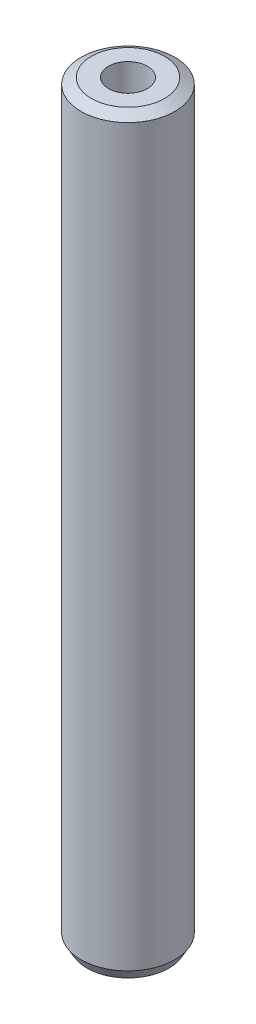
ISO-10303-21;
HEADER;
FILE_DESCRIPTION(('STEP AP214'),'2;1');
FILE_NAME('part.step','',(''),(''),'','','');
FILE_SCHEMA(('AUTOMOTIVE_DESIGN { 1 0 10303 214 1 1 1 1 }'));
ENDSEC;
DATA;
#1=APPLICATION_CONTEXT('core data for automotive mechanical design processes');
#2=APPLICATION_PROTOCOL_DEFINITION('international standard','automotive_design',2000,#1);
#3=PRODUCT_CONTEXT('',#1,'mechanical');
#4=PRODUCT('Part','Part','',(#3));
#5=PRODUCT_RELATED_PRODUCT_CATEGORY('part','',(#4));
#6=PRODUCT_DEFINITION_FORMATION('','',#4);
#7=PRODUCT_DEFINITION_CONTEXT('part definition',#1,'design');
#8=PRODUCT_DEFINITION('design','',#6,#7);
#9=PRODUCT_DEFINITION_SHAPE('','',#8);
#10=(LENGTH_UNIT() NAMED_UNIT(*) SI_UNIT(.MILLI.,.METRE.));
#11=(NAMED_UNIT(*) PLANE_ANGLE_UNIT() SI_UNIT($,.RADIAN.));
#12=(NAMED_UNIT(*) SI_UNIT($,.STERADIAN.) SOLID_ANGLE_UNIT());
#13=UNCERTAINTY_MEASURE_WITH_UNIT(LENGTH_MEASURE(1.E-05),#10,'distance_accuracy_value','');
#14=(GEOMETRIC_REPRESENTATION_CONTEXT(3) GLOBAL_UNCERTAINTY_ASSIGNED_CONTEXT((#13)) GLOBAL_UNIT_ASSIGNED_CONTEXT((#10,
#11,#12)) REPRESENTATION_CONTEXT('',''));
#15=CARTESIAN_POINT('',(0.,0.,0.));
#16=DIRECTION('',(0.,0.,1.));
#17=DIRECTION('',(1.,0.,0.));
#18=AXIS2_PLACEMENT_3D('',#15,#16,#17);
#19=CARTESIAN_POINT('',(0.,600.,0.));
#20=DIRECTION('',(0.,-1.,0.));
#21=DIRECTION('',(0.,0.,-1.));
#22=AXIS2_PLACEMENT_3D('',#19,#20,#21);
#23=CYLINDRICAL_SURFACE('',#22,37.5);
#24=CARTESIAN_POINT('',(0.,595.220577606125,0.));
#25=DIRECTION('',(0.,1.,0.));
#26=DIRECTION('',(0.,0.,1.));
#27=AXIS2_PLACEMENT_3D('',#24,#25,#26);
#28=CIRCLE('',#27,37.5);
#29=CARTESIAN_POINT('',(0.,595.220577606125,37.5));
#30=VERTEX_POINT('',#29);
#31=EDGE_CURVE('E50',#30,#30,#28,.F.);
#32=ORIENTED_EDGE('',*,*,#31,.T.);
#33=EDGE_LOOP('',(#32));
#34=FACE_BOUND('',#33,.T.);
#35=CARTESIAN_POINT('',(0.,8.27820241702459,0.));
#36=DIRECTION('',(0.,1.,0.));
#37=DIRECTION('',(0.,0.,1.));
#38=AXIS2_PLACEMENT_3D('',#35,#36,#37);
#39=CIRCLE('',#38,37.5);
#40=CARTESIAN_POINT('',(0.,8.27820241702459,37.5));
#41=VERTEX_POINT('',#40);
#42=EDGE_CURVE('E51',#41,#41,#39,.T.);
#43=ORIENTED_EDGE('',*,*,#42,.T.);
#44=EDGE_LOOP('',(#43));
#45=FACE_BOUND('',#44,.T.);
#46=ADVANCED_FACE('F39',(#34,#45),#23,.T.);
#47=CARTESIAN_POINT('',(0.,600.,0.));
#48=DIRECTION('',(0.,1.,0.));
#49=DIRECTION('',(0.,0.,1.));
#50=AXIS2_PLACEMENT_3D('',#47,#48,#49);
#51=PLANE('',#50);
#52=CARTESIAN_POINT('',(0.,600.,0.));
#53=DIRECTION('',(0.,1.,0.));
#54=DIRECTION('',(0.,0.,1.));
#55=AXIS2_PLACEMENT_3D('',#52,#53,#54);
#56=CIRCLE('',#55,29.2217975829753);
#57=CARTESIAN_POINT('',(0.,600.,29.2217975829753));
#58=VERTEX_POINT('',#57);
#59=EDGE_CURVE('E54',#58,#58,#56,.T.);
#60=ORIENTED_EDGE('',*,*,#59,.T.);
#61=EDGE_LOOP('',(#60));
#62=FACE_BOUND('',#61,.T.);
#63=CARTESIAN_POINT('',(0.,600.,0.));
#64=DIRECTION('',(0.,1.,0.));
#65=DIRECTION('',(0.,0.,1.));
#66=AXIS2_PLACEMENT_3D('',#63,#64,#65);
#67=CIRCLE('',#66,15.5380572608738);
#68=CARTESIAN_POINT('',(0.,600.,15.5380572608738));
#69=VERTEX_POINT('',#68);
#70=EDGE_CURVE('E58',#69,#69,#67,.T.);
#71=ORIENTED_EDGE('',*,*,#70,.F.);
#72=EDGE_LOOP('',(#71));
#73=FACE_BOUND('',#72,.T.);
#74=ADVANCED_FACE('F69',(#62,#73),#51,.T.);
#75=CARTESIAN_POINT('',(0.,0.,0.));
#76=DIRECTION('',(0.,1.,0.));
#77=DIRECTION('',(0.,0.,1.));
#78=AXIS2_PLACEMENT_3D('',#75,#76,#77);
#79=PLANE('',#78);
#80=CARTESIAN_POINT('',(0.,0.,0.));
#81=DIRECTION('',(0.,1.,0.));
#82=DIRECTION('',(0.,0.,1.));
#83=AXIS2_PLACEMENT_3D('',#80,#81,#82);
#84=CIRCLE('',#83,32.7205776061246);
#85=CARTESIAN_POINT('',(0.,0.,32.7205776061246));
#86=VERTEX_POINT('',#85);
#87=EDGE_CURVE('E10',#86,#86,#84,.F.);
#88=ORIENTED_EDGE('',*,*,#87,.T.);
#89=EDGE_LOOP('',(#88));
#90=FACE_BOUND('',#89,.T.);
#91=CARTESIAN_POINT('',(0.,0.,0.));
#92=DIRECTION('',(0.,1.,0.));
#93=DIRECTION('',(0.,0.,1.));
#94=AXIS2_PLACEMENT_3D('',#91,#92,#93);
#95=CIRCLE('',#94,15.5380572608738);
#96=CARTESIAN_POINT('',(0.,0.,15.5380572608738));
#97=VERTEX_POINT('',#96);
#98=EDGE_CURVE('E63',#97,#97,#95,.T.);
#99=ORIENTED_EDGE('',*,*,#98,.T.);
#100=EDGE_LOOP('',(#99));
#101=FACE_BOUND('',#100,.T.);
#102=ADVANCED_FACE('F75',(#90,#101),#79,.F.);
#103=CARTESIAN_POINT('',(0.,600.,0.));
#104=DIRECTION('',(0.,-1.,0.));
#105=DIRECTION('',(0.,0.,-1.));
#106=AXIS2_PLACEMENT_3D('',#103,#104,#105);
#107=CYLINDRICAL_SURFACE('',#106,15.5380572608738);
#108=ORIENTED_EDGE('',*,*,#70,.T.);
#109=EDGE_LOOP('',(#108));
#110=FACE_BOUND('',#109,.T.);
#111=ORIENTED_EDGE('',*,*,#98,.F.);
#112=EDGE_LOOP('',(#111));
#113=FACE_BOUND('',#112,.T.);
#114=ADVANCED_FACE('F70',(#110,#113),#107,.F.);
#115=CARTESIAN_POINT('',(0.,600.,0.));
#116=DIRECTION('',(0.,-1.,0.));
#117=DIRECTION('',(0.,0.,-1.));
#118=AXIS2_PLACEMENT_3D('',#115,#116,#117);
#119=CONICAL_SURFACE('',#118,29.2217975829753,1.0471975511966);
#120=ORIENTED_EDGE('',*,*,#31,.F.);
#121=EDGE_LOOP('',(#120));
#122=FACE_BOUND('',#121,.T.);
#123=ORIENTED_EDGE('',*,*,#59,.F.);
#124=EDGE_LOOP('',(#123));
#125=FACE_BOUND('',#124,.T.);
#126=ADVANCED_FACE('F81',(#122,#125),#119,.T.);
#127=CARTESIAN_POINT('',(0.,8.27820241702459,0.));
#128=DIRECTION('',(0.,1.,0.));
#129=DIRECTION('',(0.,0.,1.));
#130=AXIS2_PLACEMENT_3D('',#127,#128,#129);
#131=CONICAL_SURFACE('',#130,37.5,0.523598775598301);
#132=ORIENTED_EDGE('',*,*,#87,.F.);
#133=EDGE_LOOP('',(#132));
#134=FACE_BOUND('',#133,.T.);
#135=ORIENTED_EDGE('',*,*,#42,.F.);
#136=EDGE_LOOP('',(#135));
#137=FACE_BOUND('',#136,.T.);
#138=ADVANCED_FACE('F45',(#134,#137),#131,.T.);
#139=CLOSED_SHELL('',(#46,#74,#102,#114,#126,#138));
#140=MANIFOLD_SOLID_BREP('B2',#139);
#141=ADVANCED_BREP_SHAPE_REPRESENTATION('',(#18,#140),#14);
#142=SHAPE_DEFINITION_REPRESENTATION(#9,#141);
ENDSEC;
END-ISO-10303-21;
